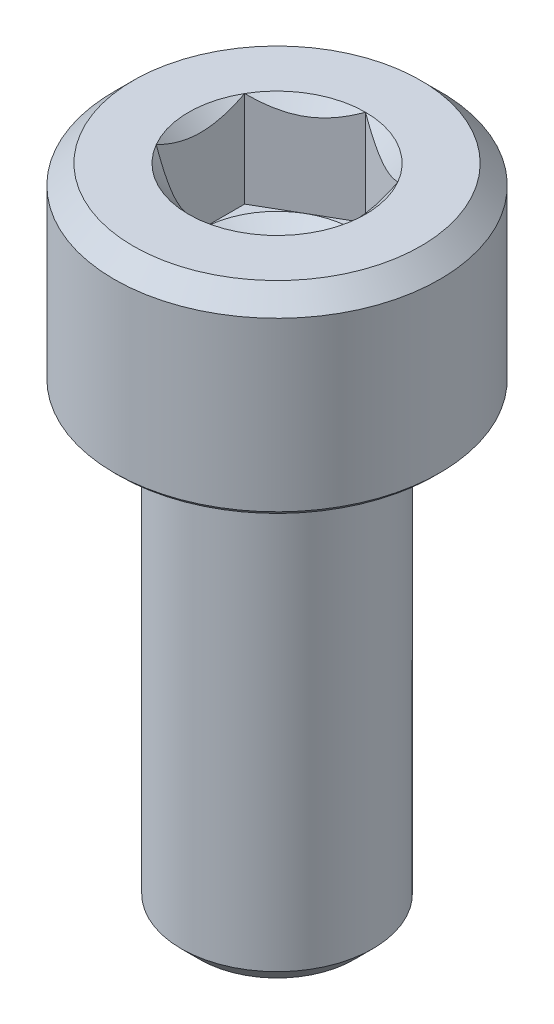
ISO-10303-21;
HEADER;
FILE_DESCRIPTION(('STEP AP214'),'2;1');
FILE_NAME('part.step','',(''),(''),'','','');
FILE_SCHEMA(('AUTOMOTIVE_DESIGN { 1 0 10303 214 1 1 1 1 }'));
ENDSEC;
DATA;
#1=APPLICATION_CONTEXT('core data for automotive mechanical design processes');
#2=APPLICATION_PROTOCOL_DEFINITION('international standard','automotive_design',2000,#1);
#3=PRODUCT_CONTEXT('',#1,'mechanical');
#4=PRODUCT('Part','Part','',(#3));
#5=PRODUCT_RELATED_PRODUCT_CATEGORY('part','',(#4));
#6=PRODUCT_DEFINITION_FORMATION('','',#4);
#7=PRODUCT_DEFINITION_CONTEXT('part definition',#1,'design');
#8=PRODUCT_DEFINITION('design','',#6,#7);
#9=PRODUCT_DEFINITION_SHAPE('','',#8);
#10=(LENGTH_UNIT() NAMED_UNIT(*) SI_UNIT(.MILLI.,.METRE.));
#11=(NAMED_UNIT(*) PLANE_ANGLE_UNIT() SI_UNIT($,.RADIAN.));
#12=(NAMED_UNIT(*) SI_UNIT($,.STERADIAN.) SOLID_ANGLE_UNIT());
#13=UNCERTAINTY_MEASURE_WITH_UNIT(LENGTH_MEASURE(1.E-05),#10,'distance_accuracy_value','');
#14=(GEOMETRIC_REPRESENTATION_CONTEXT(3) GLOBAL_UNCERTAINTY_ASSIGNED_CONTEXT((#13)) GLOBAL_UNIT_ASSIGNED_CONTEXT((#10,
#11,#12)) REPRESENTATION_CONTEXT('',''));
#15=CARTESIAN_POINT('',(0.,0.,0.));
#16=DIRECTION('',(0.,0.,1.));
#17=DIRECTION('',(1.,0.,0.));
#18=AXIS2_PLACEMENT_3D('',#15,#16,#17);
#19=CARTESIAN_POINT('',(0.,5.,0.));
#20=DIRECTION('',(0.,1.,0.));
#21=DIRECTION('',(0.,0.,1.));
#22=AXIS2_PLACEMENT_3D('',#19,#20,#21);
#23=CONICAL_SURFACE('',#22,2.3094010767585,0.785398163397443);
#24=CARTESIAN_POINT('',(0.,5.,0.));
#25=DIRECTION('',(0.,1.,0.));
#26=DIRECTION('',(0.,0.,1.));
#27=AXIS2_PLACEMENT_3D('',#24,#25,#26);
#28=CIRCLE('',#27,2.3094010767585);
#29=CARTESIAN_POINT('',(-2.,5.,-1.1547005383793));
#30=VERTEX_POINT('',#29);
#31=CARTESIAN_POINT('',(-1.99999999999995,5.,1.15470053837933));
#32=VERTEX_POINT('',#31);
#33=EDGE_CURVE('E244',#30,#32,#28,.T.);
#34=ORIENTED_EDGE('',*,*,#33,.T.);
#35=CARTESIAN_POINT('',(-2.,6.70865499521104,3.48493537924179));
#36=CARTESIAN_POINT('',(-2.,6.61927874799566,3.38184597960108));
#37=CARTESIAN_POINT('',(-2.,6.53042050100165,3.27829801866238));
#38=CARTESIAN_POINT('',(-2.,6.35410938767827,3.06992943838188));
#39=CARTESIAN_POINT('',(-2.,6.26665721017001,2.96510823693147));
#40=CARTESIAN_POINT('',(-2.,6.09162252246031,2.75150553836106));
#41=CARTESIAN_POINT('',(-2.,6.00408331853338,2.64268841410052));
#42=CARTESIAN_POINT('',(-2.,5.83166422486036,2.42300125193062));
#43=CARTESIAN_POINT('',(-2.,5.74678367399901,2.31213173546716));
#44=CARTESIAN_POINT('',(-2.,5.58057752677812,2.08751128165374));
#45=CARTESIAN_POINT('',(-2.,5.49925685260335,1.97375667808642));
#46=CARTESIAN_POINT('',(-2.,5.34184669326612,1.74250088545254));
#47=CARTESIAN_POINT('',(-2.,5.26576149836547,1.62499673652244));
#48=CARTESIAN_POINT('',(-2.,5.1220877183608,1.38607583721067));
#49=CARTESIAN_POINT('',(-2.,5.05443808556479,1.26469628611468));
#50=CARTESIAN_POINT('',(-2.,4.93125075275314,1.01594779490905));
#51=CARTESIAN_POINT('',(-2.,4.87569076817092,0.888590409780999));
#52=CARTESIAN_POINT('',(-2.,4.80571297250022,0.691083080219615));
#53=CARTESIAN_POINT('',(-2.,4.78445360220783,0.623368585918478));
#54=CARTESIAN_POINT('',(-2.,4.74782417137952,0.486345144048305));
#55=CARTESIAN_POINT('',(-2.,4.7324531708274,0.417036452850244));
#56=CARTESIAN_POINT('',(-2.,4.70862178314111,0.277659447369613));
#57=CARTESIAN_POINT('',(-2.,4.70011930731512,0.207598466966348));
#58=CARTESIAN_POINT('',(-2.,4.69049074221896,0.0669670350324534));
#59=CARTESIAN_POINT('',(-2.,4.68936387797233,-0.00360336219221853));
#60=CARTESIAN_POINT('',(-2.,4.69457684389318,-0.144553783114206));
#61=CARTESIAN_POINT('',(-2.,4.70092642398597,-0.214933437991822));
#62=CARTESIAN_POINT('',(-2.,4.72062790275544,-0.354698452121242));
#63=CARTESIAN_POINT('',(-2.,4.73398118039419,-0.424083612801693));
#64=CARTESIAN_POINT('',(-2.,4.76693306790516,-0.561849214257608));
#65=CARTESIAN_POINT('',(-2.,4.78657533412024,-0.630219027882827));
#66=CARTESIAN_POINT('',(-2.,4.83104362393443,-0.765224928840582));
#67=CARTESIAN_POINT('',(-2.,4.85586970498648,-0.831860996948566));
#68=CARTESIAN_POINT('',(-2.,4.91579733674519,-0.978223263821283));
#69=CARTESIAN_POINT('',(-2.,4.95195365366887,-1.05751393733744));
#70=CARTESIAN_POINT('',(-2.,5.02908857554939,-1.21373425446361));
#71=CARTESIAN_POINT('',(-2.,5.07006996654331,-1.29066250134966));
#72=CARTESIAN_POINT('',(-2.,5.15578343078954,-1.44259332598881));
#73=CARTESIAN_POINT('',(-2.,5.20052309801051,-1.51759158443124));
#74=CARTESIAN_POINT('',(-2.,5.29281710332292,-1.6658027451741));
#75=CARTESIAN_POINT('',(-2.,5.34037088158692,-1.73901599851123));
#76=CARTESIAN_POINT('',(-2.,5.43793273052148,-1.88434580060754));
#77=CARTESIAN_POINT('',(-2.,5.48795248279123,-1.95645447101685));
#78=CARTESIAN_POINT('',(-2.,5.58974868867912,-2.09942399496133));
#79=CARTESIAN_POINT('',(-2.,5.64152527469528,-2.17028475383773));
#80=CARTESIAN_POINT('',(-2.,5.79881562893284,-2.38113790846102));
#81=CARTESIAN_POINT('',(-2.,5.90641011816337,-2.51957625011744));
#82=CARTESIAN_POINT('',(-2.,6.12880481407568,-2.79793708137349));
#83=CARTESIAN_POINT('',(-2.,6.24372553752213,-2.93776233320845));
#84=CARTESIAN_POINT('',(-2.,6.4175122615703,-3.14503859467228));
#85=CARTESIAN_POINT('',(-2.,6.47535435122021,-3.21335225569823));
#86=CARTESIAN_POINT('',(-2.,6.59160375586807,-3.34949093797161));
#87=CARTESIAN_POINT('',(-2.,6.65001104087957,-3.41731598481301));
#88=CARTESIAN_POINT('',(-2.,6.70865499521104,-3.48493537924179));
#89=B_SPLINE_CURVE_WITH_KNOTS('',3,(#35,#36,#37,#38,#39,#40,#41,#42,#43,#44,#45,#46,#47,#48,#49,
#50,#51,#52,#53,#54,#55,#56,#57,#58,#59,#60,#61,#62,#63,#64,#65,#66,#67,#68,#69,#70,#71,#72,#73,
#74,#75,#76,#77,#78,#79,#80,#81,#82,#83,#84,#85,#86,#87,#88),.UNSPECIFIED.,.F.,.F.,(4,2,2,2,2,2,
2,2,2,2,2,2,2,2,2,2,2,2,2,2,2,2,2,2,2,2,4),(0.,0.409325277655496,0.818845319083793,
1.23778871017889,1.65662708384643,2.07602738016859,2.49576736290813,2.91226761680364,
3.32799351692011,3.54070099927128,3.75337451094884,3.96473470800344,4.17607269648514,
4.38768659336544,4.59934217067773,4.81250006998803,5.02566033188269,5.2868742678538,
5.54823977746819,5.8101467266179,6.07200174711857,6.33524589307928,6.59850992182926,
7.12440155307772,7.66733187119025,7.93586643479269,8.20438682857146),.UNSPECIFIED.);
#90=EDGE_CURVE('E131',#32,#30,#89,.T.);
#91=ORIENTED_EDGE('',*,*,#90,.T.);
#92=EDGE_LOOP('',(#34,#91));
#93=FACE_BOUND('',#92,.T.);
#94=ADVANCED_FACE('F39',(#93),#23,.F.);
#95=CARTESIAN_POINT('',(0.,5.,-2.3094010767585));
#96=VERTEX_POINT('',#95);
#97=EDGE_CURVE('E246',#96,#30,#28,.T.);
#98=ORIENTED_EDGE('',*,*,#97,.T.);
#99=CARTESIAN_POINT('',(-2.0002,5.00011547871369,-1.15458506832546));
#100=CARTESIAN_POINT('',(-1.93144696596929,4.96045309022562,-1.19427965103069));
#101=CARTESIAN_POINT('',(-1.86154425786449,4.92311998228419,-1.23463799837208));
#102=CARTESIAN_POINT('',(-1.71900475544956,4.85476368513617,-1.31693321846149));
#103=CARTESIAN_POINT('',(-1.64635440243464,4.82377853373725,-1.35887791933138));
#104=CARTESIAN_POINT('',(-1.49985839894602,4.77070021654417,-1.44345742638073));
#105=CARTESIAN_POINT('',(-1.4260500647537,4.74847362717663,-1.48607068799511));
#106=CARTESIAN_POINT('',(-1.27680836816473,4.7142288166751,-1.57223542169506));
#107=CARTESIAN_POINT('',(-1.20137956608184,4.70218502914416,-1.61578426088227));
#108=CARTESIAN_POINT('',(-1.07138449932891,4.69131851190559,-1.69083694766539));
#109=CARTESIAN_POINT('',(-1.01698621602988,4.68970975360999,-1.72224381117154));
#110=CARTESIAN_POINT('',(-0.908278544480294,4.69241887759873,-1.78500621460366));
#111=CARTESIAN_POINT('',(-0.853969194078648,4.69673883775799,-1.81636173267757));
#112=CARTESIAN_POINT('',(-0.745863272410649,4.71105956740992,-1.87877671565358));
#113=CARTESIAN_POINT('',(-0.692067343445194,4.72106669276202,-1.90983580972309));
#114=CARTESIAN_POINT('',(-0.585405737694413,4.74621243024967,-1.97141691651549));
#115=CARTESIAN_POINT('',(-0.532539989929274,4.76135064904225,-2.00193897021861));
#116=CARTESIAN_POINT('',(-0.397120266910144,4.8062945034292,-2.08012358375728));
#117=CARTESIAN_POINT('',(-0.315406165150512,4.83948883942583,-2.12730124240479));
#118=CARTESIAN_POINT('',(-0.195252962742192,4.89552582317138,-2.19667172615923));
#119=CARTESIAN_POINT('',(-0.155657147890818,4.91521470294695,-2.21953238052245));
#120=CARTESIAN_POINT('',(-0.0771990411121251,4.95638731836488,-2.26483018959124));
#121=CARTESIAN_POINT('',(-0.0383363164062583,4.97786995165125,-2.28726759416161));
#122=CARTESIAN_POINT('',(0.000200000000000129,5.00011547871366,-2.30951654681234));
#123=B_SPLINE_CURVE_WITH_KNOTS('',3,(#99,#100,#101,#102,#103,#104,#105,#106,#107,#108,#109,#110,
#111,#112,#113,#114,#115,#116,#117,#118,#119,#120,#121,#122),.UNSPECIFIED.,.F.,.F.,(4,2,2,2,2,2,
2,2,2,2,2,4),(0.,0.266420613771064,0.53439375152339,0.798110374376917,1.06116288956937,
1.24939906803722,1.43770123566248,1.62621426093932,1.81471283831913,2.11415604834143,
2.26347170717788,2.41269626969768),.UNSPECIFIED.);
#124=EDGE_CURVE('E206',#30,#96,#123,.T.);
#125=ORIENTED_EDGE('',*,*,#124,.T.);
#126=EDGE_LOOP('',(#98,#125));
#127=FACE_BOUND('',#126,.T.);
#128=ADVANCED_FACE('F290',(#127),#23,.F.);
#129=CARTESIAN_POINT('',(2.,5.,-1.1547005383793));
#130=VERTEX_POINT('',#129);
#131=EDGE_CURVE('E243',#130,#96,#28,.T.);
#132=ORIENTED_EDGE('',*,*,#131,.T.);
#133=CARTESIAN_POINT('',(-0.0002,5.00011547871366,-2.30951654681234));
#134=CARTESIAN_POINT('',(0.0685530340307034,4.96045309022559,-2.26982196410711));
#135=CARTESIAN_POINT('',(0.138455742135508,4.92311998228417,-2.22946361676572));
#136=CARTESIAN_POINT('',(0.280995244550428,4.85476368513615,-2.14716839667631));
#137=CARTESIAN_POINT('',(0.353645597565348,4.82377853373723,-2.10522369580643));
#138=CARTESIAN_POINT('',(0.500141601053956,4.77070021654416,-2.02064418875708));
#139=CARTESIAN_POINT('',(0.573949935246276,4.74847362717663,-1.97803092714271));
#140=CARTESIAN_POINT('',(0.723191631835241,4.7142288166751,-1.89186619344276));
#141=CARTESIAN_POINT('',(0.798620433918126,4.70218502914415,-1.84831735425555));
#142=CARTESIAN_POINT('',(0.928615500671051,4.69131851190559,-1.77326466747243));
#143=CARTESIAN_POINT('',(0.983013783970081,4.68970975360999,-1.74185780396629));
#144=CARTESIAN_POINT('',(1.09172145551967,4.69241887759873,-1.67909540053416));
#145=CARTESIAN_POINT('',(1.14603080592131,4.69673883775799,-1.64773988246026));
#146=CARTESIAN_POINT('',(1.25413672758931,4.71105956740992,-1.58532489948425));
#147=CARTESIAN_POINT('',(1.30793265655476,4.72106669276202,-1.55426580541474));
#148=CARTESIAN_POINT('',(1.41459426230555,4.74621243024968,-1.49268469862233));
#149=CARTESIAN_POINT('',(1.46746001007068,4.76135064904226,-1.46216264491922));
#150=CARTESIAN_POINT('',(1.60287973308982,4.80629450342921,-1.38397803138054));
#151=CARTESIAN_POINT('',(1.68459383484946,4.83948883942584,-1.33680037273302));
#152=CARTESIAN_POINT('',(1.80474703725779,4.89552582317139,-1.26742988897858));
#153=CARTESIAN_POINT('',(1.84434285210917,4.91521470294696,-1.24456923461536));
#154=CARTESIAN_POINT('',(1.92280095888787,4.9563873183649,-1.19927142554657));
#155=CARTESIAN_POINT('',(1.96166368359374,4.97786995165127,-1.17683402097619));
#156=CARTESIAN_POINT('',(2.0002,5.00011547871369,-1.15458506832546));
#157=B_SPLINE_CURVE_WITH_KNOTS('',3,(#133,#134,#135,#136,#137,#138,#139,#140,#141,#142,#143,
#144,#145,#146,#147,#148,#149,#150,#151,#152,#153,#154,#155,#156),.UNSPECIFIED.,.F.,.F.,(4,2,2,
2,2,2,2,2,2,2,2,4),(0.,0.266420613771052,0.534393751523364,0.798110374376878,1.06116288956932,
1.24939906803717,1.43770123566242,1.62621426093926,1.81471283831908,2.11415604834141,
2.26347170717787,2.41269626969768),.UNSPECIFIED.);
#158=EDGE_CURVE('E257',#96,#130,#157,.T.);
#159=ORIENTED_EDGE('',*,*,#158,.T.);
#160=EDGE_LOOP('',(#132,#159));
#161=FACE_BOUND('',#160,.T.);
#162=ADVANCED_FACE('F255',(#161),#23,.F.);
#163=CARTESIAN_POINT('',(2.,5.,1.1547005383793));
#164=VERTEX_POINT('',#163);
#165=EDGE_CURVE('E238',#164,#130,#28,.T.);
#166=ORIENTED_EDGE('',*,*,#165,.T.);
#167=CARTESIAN_POINT('',(2.,6.70865499521104,-3.48493537924179));
#168=CARTESIAN_POINT('',(2.,6.61927874799566,-3.38184597960108));
#169=CARTESIAN_POINT('',(2.,6.53042050100165,-3.27829801866238));
#170=CARTESIAN_POINT('',(2.,6.35410938767827,-3.06992943838188));
#171=CARTESIAN_POINT('',(2.,6.26665721017001,-2.96510823693147));
#172=CARTESIAN_POINT('',(2.,6.09162252246031,-2.75150553836106));
#173=CARTESIAN_POINT('',(2.,6.00408331853338,-2.64268841410052));
#174=CARTESIAN_POINT('',(2.,5.83166422486036,-2.42300125193062));
#175=CARTESIAN_POINT('',(2.,5.74678367399901,-2.31213173546716));
#176=CARTESIAN_POINT('',(2.,5.58057752677812,-2.08751128165374));
#177=CARTESIAN_POINT('',(2.,5.49925685260335,-1.97375667808642));
#178=CARTESIAN_POINT('',(2.,5.34184669326612,-1.74250088545254));
#179=CARTESIAN_POINT('',(2.,5.26576149836547,-1.62499673652244));
#180=CARTESIAN_POINT('',(2.,5.1220877183608,-1.38607583721067));
#181=CARTESIAN_POINT('',(2.,5.05443808556479,-1.26469628611468));
#182=CARTESIAN_POINT('',(2.,4.93125075275314,-1.01594779490905));
#183=CARTESIAN_POINT('',(2.,4.87569076817092,-0.888590409780999));
#184=CARTESIAN_POINT('',(2.,4.80571297250022,-0.691083080219615));
#185=CARTESIAN_POINT('',(2.,4.78445360220783,-0.623368585918478));
#186=CARTESIAN_POINT('',(2.,4.74782417137952,-0.486345144048305));
#187=CARTESIAN_POINT('',(2.,4.7324531708274,-0.417036452850244));
#188=CARTESIAN_POINT('',(2.,4.70862178314111,-0.277659447369613));
#189=CARTESIAN_POINT('',(2.,4.70011930731512,-0.207598466966348));
#190=CARTESIAN_POINT('',(2.,4.69049074221896,-0.0669670350324534));
#191=CARTESIAN_POINT('',(2.,4.68936387797233,0.00360336219221853));
#192=CARTESIAN_POINT('',(2.,4.69457684389318,0.144553783114206));
#193=CARTESIAN_POINT('',(2.,4.70092642398597,0.214933437991822));
#194=CARTESIAN_POINT('',(2.,4.72062790275544,0.354698452121242));
#195=CARTESIAN_POINT('',(2.,4.73398118039419,0.424083612801693));
#196=CARTESIAN_POINT('',(2.,4.76693306790516,0.561849214257608));
#197=CARTESIAN_POINT('',(2.,4.78657533412024,0.630219027882827));
#198=CARTESIAN_POINT('',(2.,4.83104362393443,0.765224928840582));
#199=CARTESIAN_POINT('',(2.,4.85586970498648,0.831860996948566));
#200=CARTESIAN_POINT('',(2.,4.91579733674519,0.978223263821283));
#201=CARTESIAN_POINT('',(2.,4.95195365366887,1.05751393733744));
#202=CARTESIAN_POINT('',(2.,5.02908857554939,1.21373425446361));
#203=CARTESIAN_POINT('',(2.,5.07006996654331,1.29066250134966));
#204=CARTESIAN_POINT('',(2.,5.15578343078954,1.44259332598881));
#205=CARTESIAN_POINT('',(2.,5.20052309801051,1.51759158443124));
#206=CARTESIAN_POINT('',(2.,5.29281710332292,1.6658027451741));
#207=CARTESIAN_POINT('',(2.,5.34037088158692,1.73901599851123));
#208=CARTESIAN_POINT('',(2.,5.43793273052148,1.88434580060754));
#209=CARTESIAN_POINT('',(2.,5.48795248279123,1.95645447101685));
#210=CARTESIAN_POINT('',(2.,5.58974868867912,2.09942399496133));
#211=CARTESIAN_POINT('',(2.,5.64152527469528,2.17028475383773));
#212=CARTESIAN_POINT('',(2.,5.79881562893284,2.38113790846102));
#213=CARTESIAN_POINT('',(2.,5.90641011816337,2.51957625011744));
#214=CARTESIAN_POINT('',(2.,6.12880481407568,2.79793708137349));
#215=CARTESIAN_POINT('',(2.,6.24372553752213,2.93776233320845));
#216=CARTESIAN_POINT('',(2.,6.4175122615703,3.14503859467228));
#217=CARTESIAN_POINT('',(2.,6.47535435122021,3.21335225569823));
#218=CARTESIAN_POINT('',(2.,6.59160375586807,3.34949093797161));
#219=CARTESIAN_POINT('',(2.,6.65001104087957,3.41731598481301));
#220=CARTESIAN_POINT('',(2.,6.70865499521104,3.48493537924179));
#221=B_SPLINE_CURVE_WITH_KNOTS('',3,(#167,#168,#169,#170,#171,#172,#173,#174,#175,#176,#177,
#178,#179,#180,#181,#182,#183,#184,#185,#186,#187,#188,#189,#190,#191,#192,#193,#194,#195,#196,
#197,#198,#199,#200,#201,#202,#203,#204,#205,#206,#207,#208,#209,#210,#211,#212,#213,#214,#215,
#216,#217,#218,#219,#220),.UNSPECIFIED.,.F.,.F.,(4,2,2,2,2,2,2,2,2,2,2,2,2,2,2,2,2,2,2,2,2,2,2,
2,2,2,4),(0.,0.409325277655496,0.818845319083793,1.23778871017889,1.65662708384643,
2.07602738016859,2.49576736290813,2.91226761680364,3.32799351692011,3.54070099927128,
3.75337451094884,3.96473470800344,4.17607269648514,4.38768659336544,4.59934217067773,
4.81250006998803,5.02566033188269,5.2868742678538,5.54823977746819,5.8101467266179,
6.07200174711857,6.33524589307928,6.59850992182926,7.12440155307772,7.66733187119025,
7.93586643479269,8.20438682857146),.UNSPECIFIED.);
#222=EDGE_CURVE('E265',#130,#164,#221,.T.);
#223=ORIENTED_EDGE('',*,*,#222,.T.);
#224=EDGE_LOOP('',(#166,#223));
#225=FACE_BOUND('',#224,.T.);
#226=ADVANCED_FACE('F264',(#225),#23,.F.);
#227=CARTESIAN_POINT('',(0.,5.,2.3094010767585));
#228=VERTEX_POINT('',#227);
#229=EDGE_CURVE('E236',#228,#164,#28,.T.);
#230=ORIENTED_EDGE('',*,*,#229,.T.);
#231=CARTESIAN_POINT('',(2.0002,5.00011547871369,1.15458506832546));
#232=CARTESIAN_POINT('',(1.93144696596929,4.96045309022562,1.19427965103069));
#233=CARTESIAN_POINT('',(1.86154425786449,4.92311998228419,1.23463799837208));
#234=CARTESIAN_POINT('',(1.71900475544956,4.85476368513617,1.31693321846149));
#235=CARTESIAN_POINT('',(1.64635440243464,4.82377853373725,1.35887791933138));
#236=CARTESIAN_POINT('',(1.49985839894602,4.77070021654417,1.44345742638073));
#237=CARTESIAN_POINT('',(1.4260500647537,4.74847362717663,1.48607068799511));
#238=CARTESIAN_POINT('',(1.27680836816473,4.7142288166751,1.57223542169506));
#239=CARTESIAN_POINT('',(1.20137956608184,4.70218502914416,1.61578426088227));
#240=CARTESIAN_POINT('',(1.07138449932891,4.69131851190559,1.69083694766539));
#241=CARTESIAN_POINT('',(1.01698621602988,4.68970975360999,1.72224381117154));
#242=CARTESIAN_POINT('',(0.908278544480294,4.69241887759873,1.78500621460366));
#243=CARTESIAN_POINT('',(0.853969194078648,4.69673883775799,1.81636173267757));
#244=CARTESIAN_POINT('',(0.745863272410649,4.71105956740992,1.87877671565358));
#245=CARTESIAN_POINT('',(0.692067343445194,4.72106669276202,1.90983580972309));
#246=CARTESIAN_POINT('',(0.585405737694413,4.74621243024967,1.97141691651549));
#247=CARTESIAN_POINT('',(0.532539989929274,4.76135064904225,2.00193897021861));
#248=CARTESIAN_POINT('',(0.397120266910144,4.8062945034292,2.08012358375728));
#249=CARTESIAN_POINT('',(0.315406165150512,4.83948883942583,2.12730124240479));
#250=CARTESIAN_POINT('',(0.195252962742192,4.89552582317138,2.19667172615923));
#251=CARTESIAN_POINT('',(0.155657147890818,4.91521470294695,2.21953238052245));
#252=CARTESIAN_POINT('',(0.0771990411121251,4.95638731836488,2.26483018959124));
#253=CARTESIAN_POINT('',(0.0383363164062583,4.97786995165125,2.28726759416161));
#254=CARTESIAN_POINT('',(-0.000200000000000129,5.00011547871366,2.30951654681234));
#255=B_SPLINE_CURVE_WITH_KNOTS('',3,(#231,#232,#233,#234,#235,#236,#237,#238,#239,#240,#241,
#242,#243,#244,#245,#246,#247,#248,#249,#250,#251,#252,#253,#254),.UNSPECIFIED.,.F.,.F.,(4,2,2,
2,2,2,2,2,2,2,2,4),(0.,0.266420613771064,0.53439375152339,0.798110374376917,1.06116288956937,
1.24939906803722,1.43770123566248,1.62621426093932,1.81471283831913,2.11415604834143,
2.26347170717788,2.41269626969768),.UNSPECIFIED.);
#256=EDGE_CURVE('E175',#164,#228,#255,.T.);
#257=ORIENTED_EDGE('',*,*,#256,.T.);
#258=EDGE_LOOP('',(#230,#257));
#259=FACE_BOUND('',#258,.T.);
#260=ADVANCED_FACE('F295',(#259),#23,.F.);
#261=EDGE_CURVE('E235',#32,#228,#28,.T.);
#262=ORIENTED_EDGE('',*,*,#261,.T.);
#263=CARTESIAN_POINT('',(0.0002,5.00011547871366,2.30951654681234));
#264=CARTESIAN_POINT('',(-0.0685530340307034,4.96045309022559,2.26982196410711));
#265=CARTESIAN_POINT('',(-0.138455742135508,4.92311998228417,2.22946361676572));
#266=CARTESIAN_POINT('',(-0.280995244550428,4.85476368513615,2.14716839667631));
#267=CARTESIAN_POINT('',(-0.353645597565348,4.82377853373723,2.10522369580643));
#268=CARTESIAN_POINT('',(-0.500141601053956,4.77070021654416,2.02064418875708));
#269=CARTESIAN_POINT('',(-0.573949935246276,4.74847362717663,1.97803092714271));
#270=CARTESIAN_POINT('',(-0.723191631835241,4.7142288166751,1.89186619344276));
#271=CARTESIAN_POINT('',(-0.798620433918126,4.70218502914415,1.84831735425555));
#272=CARTESIAN_POINT('',(-0.928615500671051,4.69131851190559,1.77326466747243));
#273=CARTESIAN_POINT('',(-0.983013783970081,4.68970975360999,1.74185780396629));
#274=CARTESIAN_POINT('',(-1.09172145551967,4.69241887759873,1.67909540053416));
#275=CARTESIAN_POINT('',(-1.14603080592131,4.69673883775799,1.64773988246026));
#276=CARTESIAN_POINT('',(-1.25413672758931,4.71105956740992,1.58532489948425));
#277=CARTESIAN_POINT('',(-1.30793265655476,4.72106669276202,1.55426580541474));
#278=CARTESIAN_POINT('',(-1.41459426230555,4.74621243024968,1.49268469862233));
#279=CARTESIAN_POINT('',(-1.46746001007068,4.76135064904226,1.46216264491922));
#280=CARTESIAN_POINT('',(-1.60287973308982,4.80629450342921,1.38397803138054));
#281=CARTESIAN_POINT('',(-1.68459383484946,4.83948883942584,1.33680037273302));
#282=CARTESIAN_POINT('',(-1.80474703725779,4.89552582317139,1.26742988897858));
#283=CARTESIAN_POINT('',(-1.84434285210917,4.91521470294696,1.24456923461536));
#284=CARTESIAN_POINT('',(-1.92280095888787,4.9563873183649,1.19927142554657));
#285=CARTESIAN_POINT('',(-1.96166368359374,4.97786995165127,1.17683402097619));
#286=CARTESIAN_POINT('',(-2.0002,5.00011547871369,1.15458506832546));
#287=B_SPLINE_CURVE_WITH_KNOTS('',3,(#263,#264,#265,#266,#267,#268,#269,#270,#271,#272,#273,
#274,#275,#276,#277,#278,#279,#280,#281,#282,#283,#284,#285,#286),.UNSPECIFIED.,.F.,.F.,(4,2,2,
2,2,2,2,2,2,2,2,4),(0.,0.266420613771052,0.534393751523364,0.798110374376878,1.06116288956932,
1.24939906803717,1.43770123566242,1.62621426093926,1.81471283831908,2.11415604834141,
2.26347170717787,2.41269626969768),.UNSPECIFIED.);
#288=EDGE_CURVE('E62',#228,#32,#287,.T.);
#289=ORIENTED_EDGE('',*,*,#288,.T.);
#290=EDGE_LOOP('',(#262,#289));
#291=FACE_BOUND('',#290,.T.);
#292=ADVANCED_FACE('F182',(#291),#23,.F.);
#293=CARTESIAN_POINT('',(2.3094010767585,5.,0.));
#294=DIRECTION('',(0.,-1.,0.));
#295=DIRECTION('',(0.,0.,-1.));
#296=AXIS2_PLACEMENT_3D('',#293,#294,#295);
#297=PLANE('',#296);
#298=ORIENTED_EDGE('',*,*,#229,.F.);
#299=ORIENTED_EDGE('',*,*,#261,.F.);
#300=ORIENTED_EDGE('',*,*,#33,.F.);
#301=ORIENTED_EDGE('',*,*,#97,.F.);
#302=ORIENTED_EDGE('',*,*,#131,.F.);
#303=ORIENTED_EDGE('',*,*,#165,.F.);
#304=EDGE_LOOP('',(#298,#299,#300,#301,#302,#303));
#305=FACE_BOUND('',#304,.T.);
#306=CARTESIAN_POINT('',(0.,5.,0.));
#307=DIRECTION('',(0.,1.,0.));
#308=DIRECTION('',(0.,0.,1.));
#309=AXIS2_PLACEMENT_3D('',#306,#307,#308);
#310=CIRCLE('',#309,3.75);
#311=CARTESIAN_POINT('',(0.,5.,3.75));
#312=VERTEX_POINT('',#311);
#313=EDGE_CURVE('E233',#312,#312,#310,.T.);
#314=ORIENTED_EDGE('',*,*,#313,.T.);
#315=EDGE_LOOP('',(#314));
#316=FACE_BOUND('',#315,.T.);
#317=ADVANCED_FACE('F261',(#305,#316),#297,.F.);
#318=CARTESIAN_POINT('',(0.,4.5,0.));
#319=DIRECTION('',(0.,-1.,0.));
#320=DIRECTION('',(0.,0.,-1.));
#321=AXIS2_PLACEMENT_3D('',#318,#319,#320);
#322=CONICAL_SURFACE('',#321,4.25,0.785398163397448);
#323=ORIENTED_EDGE('',*,*,#313,.F.);
#324=EDGE_LOOP('',(#323));
#325=FACE_BOUND('',#324,.T.);
#326=CARTESIAN_POINT('',(0.,4.5,0.));
#327=DIRECTION('',(0.,1.,0.));
#328=DIRECTION('',(0.,0.,1.));
#329=AXIS2_PLACEMENT_3D('',#326,#327,#328);
#330=CIRCLE('',#329,4.25);
#331=CARTESIAN_POINT('',(0.,4.5,4.25));
#332=VERTEX_POINT('',#331);
#333=EDGE_CURVE('E230',#332,#332,#330,.T.);
#334=ORIENTED_EDGE('',*,*,#333,.T.);
#335=EDGE_LOOP('',(#334));
#336=FACE_BOUND('',#335,.T.);
#337=ADVANCED_FACE('F300',(#325,#336),#322,.T.);
#338=CARTESIAN_POINT('',(0.,-12.,0.));
#339=DIRECTION('',(0.,1.,0.));
#340=DIRECTION('',(0.,0.,1.));
#341=AXIS2_PLACEMENT_3D('',#338,#339,#340);
#342=CYLINDRICAL_SURFACE('',#341,4.25);
#343=ORIENTED_EDGE('',*,*,#333,.F.);
#344=EDGE_LOOP('',(#343));
#345=FACE_BOUND('',#344,.T.);
#346=CARTESIAN_POINT('',(0.,0.125,0.));
#347=DIRECTION('',(0.,1.,0.));
#348=DIRECTION('',(0.,0.,1.));
#349=AXIS2_PLACEMENT_3D('',#346,#347,#348);
#350=CIRCLE('',#349,4.25);
#351=CARTESIAN_POINT('',(0.,0.125,4.25));
#352=VERTEX_POINT('',#351);
#353=EDGE_CURVE('E227',#352,#352,#350,.T.);
#354=ORIENTED_EDGE('',*,*,#353,.T.);
#355=EDGE_LOOP('',(#354));
#356=FACE_BOUND('',#355,.T.);
#357=ADVANCED_FACE('F378',(#345,#356),#342,.T.);
#358=CARTESIAN_POINT('',(0.,0.,0.));
#359=DIRECTION('',(0.,1.,0.));
#360=DIRECTION('',(0.,0.,1.));
#361=AXIS2_PLACEMENT_3D('',#358,#359,#360);
#362=CONICAL_SURFACE('',#361,4.125,0.785398163397448);
#363=ORIENTED_EDGE('',*,*,#353,.F.);
#364=EDGE_LOOP('',(#363));
#365=FACE_BOUND('',#364,.T.);
#366=CARTESIAN_POINT('',(0.,0.,0.));
#367=DIRECTION('',(0.,1.,0.));
#368=DIRECTION('',(0.,0.,1.));
#369=AXIS2_PLACEMENT_3D('',#366,#367,#368);
#370=CIRCLE('',#369,4.125);
#371=CARTESIAN_POINT('',(0.,0.,4.125));
#372=VERTEX_POINT('',#371);
#373=EDGE_CURVE('E224',#372,#372,#370,.T.);
#374=ORIENTED_EDGE('',*,*,#373,.T.);
#375=EDGE_LOOP('',(#374));
#376=FACE_BOUND('',#375,.T.);
#377=ADVANCED_FACE('F382',(#365,#376),#362,.T.);
#378=CARTESIAN_POINT('',(4.125,0.,0.));
#379=DIRECTION('',(0.,1.,0.));
#380=DIRECTION('',(0.,0.,1.));
#381=AXIS2_PLACEMENT_3D('',#378,#379,#380);
#382=PLANE('',#381);
#383=ORIENTED_EDGE('',*,*,#373,.F.);
#384=EDGE_LOOP('',(#383));
#385=FACE_BOUND('',#384,.T.);
#386=CARTESIAN_POINT('',(0.,0.,0.));
#387=DIRECTION('',(0.,1.,0.));
#388=DIRECTION('',(0.,0.,1.));
#389=AXIS2_PLACEMENT_3D('',#386,#387,#388);
#390=CIRCLE('',#389,2.55);
#391=CARTESIAN_POINT('',(0.,0.,2.55));
#392=VERTEX_POINT('',#391);
#393=EDGE_CURVE('E221',#392,#392,#390,.T.);
#394=ORIENTED_EDGE('',*,*,#393,.T.);
#395=EDGE_LOOP('',(#394));
#396=FACE_BOUND('',#395,.T.);
#397=ADVANCED_FACE('F438',(#385,#396),#382,.F.);
#398=CARTESIAN_POINT('',(0.,-0.6,0.));
#399=DIRECTION('',(0.,1.,0.));
#400=DIRECTION('',(0.,0.,1.));
#401=AXIS2_PLACEMENT_3D('',#398,#399,#400);
#402=CONICAL_SURFACE('',#401,2.5,0.0831412318884407);
#403=ORIENTED_EDGE('',*,*,#393,.F.);
#404=EDGE_LOOP('',(#403));
#405=FACE_BOUND('',#404,.T.);
#406=CARTESIAN_POINT('',(0.,-0.6,0.));
#407=DIRECTION('',(0.,1.,0.));
#408=DIRECTION('',(0.,0.,1.));
#409=AXIS2_PLACEMENT_3D('',#406,#407,#408);
#410=CIRCLE('',#409,2.5);
#411=CARTESIAN_POINT('',(0.,-0.6,2.5));
#412=VERTEX_POINT('',#411);
#413=EDGE_CURVE('E218',#412,#412,#410,.T.);
#414=ORIENTED_EDGE('',*,*,#413,.T.);
#415=EDGE_LOOP('',(#414));
#416=FACE_BOUND('',#415,.T.);
#417=ADVANCED_FACE('F427',(#405,#416),#402,.T.);
#418=CARTESIAN_POINT('',(0.,-12.,0.));
#419=DIRECTION('',(0.,1.,0.));
#420=DIRECTION('',(0.,0.,1.));
#421=AXIS2_PLACEMENT_3D('',#418,#419,#420);
#422=CYLINDRICAL_SURFACE('',#421,2.5);
#423=ORIENTED_EDGE('',*,*,#413,.F.);
#424=EDGE_LOOP('',(#423));
#425=FACE_BOUND('',#424,.T.);
#426=CARTESIAN_POINT('',(0.,-11.5095,0.));
#427=DIRECTION('',(0.,1.,0.));
#428=DIRECTION('',(0.,0.,1.));
#429=AXIS2_PLACEMENT_3D('',#426,#427,#428);
#430=CIRCLE('',#429,2.5);
#431=CARTESIAN_POINT('',(0.,-11.5095,2.5));
#432=VERTEX_POINT('',#431);
#433=EDGE_CURVE('E215',#432,#432,#430,.T.);
#434=ORIENTED_EDGE('',*,*,#433,.T.);
#435=EDGE_LOOP('',(#434));
#436=FACE_BOUND('',#435,.T.);
#437=ADVANCED_FACE('F321',(#425,#436),#422,.T.);
#438=CARTESIAN_POINT('',(0.,-12.,0.));
#439=DIRECTION('',(0.,1.,0.));
#440=DIRECTION('',(0.,0.,1.));
#441=AXIS2_PLACEMENT_3D('',#438,#439,#440);
#442=CONICAL_SURFACE('',#441,2.0095,0.785398163397447);
#443=ORIENTED_EDGE('',*,*,#433,.F.);
#444=EDGE_LOOP('',(#443));
#445=FACE_BOUND('',#444,.T.);
#446=CARTESIAN_POINT('',(0.,-12.,0.));
#447=DIRECTION('',(0.,1.,0.));
#448=DIRECTION('',(0.,0.,1.));
#449=AXIS2_PLACEMENT_3D('',#446,#447,#448);
#450=CIRCLE('',#449,2.0095);
#451=CARTESIAN_POINT('',(0.,-12.,2.0095));
#452=VERTEX_POINT('',#451);
#453=EDGE_CURVE('E205',#452,#452,#450,.T.);
#454=ORIENTED_EDGE('',*,*,#453,.T.);
#455=EDGE_LOOP('',(#454));
#456=FACE_BOUND('',#455,.T.);
#457=ADVANCED_FACE('F404',(#445,#456),#442,.T.);
#458=CARTESIAN_POINT('',(2.0095,-12.,0.));
#459=DIRECTION('',(0.,1.,0.));
#460=DIRECTION('',(0.,0.,1.));
#461=AXIS2_PLACEMENT_3D('',#458,#459,#460);
#462=PLANE('',#461);
#463=ORIENTED_EDGE('',*,*,#453,.F.);
#464=EDGE_LOOP('',(#463));
#465=FACE_BOUND('',#464,.T.);
#466=ADVANCED_FACE('F196',(#465),#462,.F.);
#467=CARTESIAN_POINT('',(0.,2.5,0.));
#468=DIRECTION('',(0.,1.,0.));
#469=DIRECTION('',(0.,0.,1.));
#470=AXIS2_PLACEMENT_3D('',#467,#468,#469);
#471=PLANE('',#470);
#472=CARTESIAN_POINT('',(0.,2.5,0.));
#473=DIRECTION('',(0.,1.,0.));
#474=DIRECTION('',(0.,0.,1.));
#475=AXIS2_PLACEMENT_3D('',#472,#473,#474);
#476=CIRCLE('',#475,2.);
#477=CARTESIAN_POINT('',(-2.,2.5,0.));
#478=VERTEX_POINT('',#477);
#479=CARTESIAN_POINT('',(-0.999999999999976,2.5,1.73205080756891));
#480=VERTEX_POINT('',#479);
#481=EDGE_CURVE('E121',#478,#480,#476,.T.);
#482=ORIENTED_EDGE('',*,*,#481,.F.);
#483=DIRECTION('',(0.,0.,1.));
#484=VECTOR('',#483,1.);
#485=CARTESIAN_POINT('',(-2.,2.5,-1.1547005383793));
#486=LINE('',#485,#484);
#487=CARTESIAN_POINT('',(-2.,2.5,1.1547005383793));
#488=VERTEX_POINT('',#487);
#489=EDGE_CURVE('E115',#478,#488,#486,.T.);
#490=ORIENTED_EDGE('',*,*,#489,.T.);
#491=DIRECTION('',(0.866025403784448,0.,0.499999999999983));
#492=VECTOR('',#491,1.);
#493=CARTESIAN_POINT('',(-2.,2.5,1.1547005383793));
#494=LINE('',#493,#492);
#495=EDGE_CURVE('E119',#488,#480,#494,.T.);
#496=ORIENTED_EDGE('',*,*,#495,.T.);
#497=EDGE_LOOP('',(#482,#490,#496));
#498=FACE_BOUND('',#497,.T.);
#499=ADVANCED_FACE('F117',(#498),#471,.T.);
#500=CARTESIAN_POINT('',(-0.999999999999976,2.5,-1.73205080756891));
#501=VERTEX_POINT('',#500);
#502=EDGE_CURVE('E528',#501,#478,#476,.T.);
#503=ORIENTED_EDGE('',*,*,#502,.F.);
#504=DIRECTION('',(-0.866025403784448,0.,0.499999999999983));
#505=VECTOR('',#504,1.);
#506=CARTESIAN_POINT('',(0.,2.5,-2.3094010767585));
#507=LINE('',#506,#505);
#508=CARTESIAN_POINT('',(-2.,2.5,-1.1547005383793));
#509=VERTEX_POINT('',#508);
#510=EDGE_CURVE('E153',#501,#509,#507,.T.);
#511=ORIENTED_EDGE('',*,*,#510,.T.);
#512=EDGE_CURVE('E125',#509,#478,#486,.T.);
#513=ORIENTED_EDGE('',*,*,#512,.T.);
#514=EDGE_LOOP('',(#503,#511,#513));
#515=FACE_BOUND('',#514,.T.);
#516=ADVANCED_FACE('F288',(#515),#471,.T.);
#517=CARTESIAN_POINT('',(0.999999999999976,2.5,-1.73205080756891));
#518=VERTEX_POINT('',#517);
#519=EDGE_CURVE('E527',#518,#501,#476,.T.);
#520=ORIENTED_EDGE('',*,*,#519,.F.);
#521=DIRECTION('',(-0.866025403784448,0.,-0.499999999999983));
#522=VECTOR('',#521,1.);
#523=CARTESIAN_POINT('',(2.,2.5,-1.1547005383793));
#524=LINE('',#523,#522);
#525=CARTESIAN_POINT('',(0.,2.5,-2.3094010767585));
#526=VERTEX_POINT('',#525);
#527=EDGE_CURVE('E149',#518,#526,#524,.T.);
#528=ORIENTED_EDGE('',*,*,#527,.T.);
#529=EDGE_CURVE('E135',#526,#501,#507,.T.);
#530=ORIENTED_EDGE('',*,*,#529,.T.);
#531=EDGE_LOOP('',(#520,#528,#530));
#532=FACE_BOUND('',#531,.T.);
#533=ADVANCED_FACE('F472',(#532),#471,.T.);
#534=CARTESIAN_POINT('',(2.,2.5,0.));
#535=VERTEX_POINT('',#534);
#536=EDGE_CURVE('E47',#535,#518,#476,.T.);
#537=ORIENTED_EDGE('',*,*,#536,.F.);
#538=DIRECTION('',(0.,0.,-1.));
#539=VECTOR('',#538,1.);
#540=CARTESIAN_POINT('',(2.,2.5,1.1547005383793));
#541=LINE('',#540,#539);
#542=CARTESIAN_POINT('',(2.,2.5,-1.1547005383793));
#543=VERTEX_POINT('',#542);
#544=EDGE_CURVE('E145',#535,#543,#541,.T.);
#545=ORIENTED_EDGE('',*,*,#544,.T.);
#546=EDGE_CURVE('E150',#543,#518,#524,.T.);
#547=ORIENTED_EDGE('',*,*,#546,.T.);
#548=EDGE_LOOP('',(#537,#545,#547));
#549=FACE_BOUND('',#548,.T.);
#550=ADVANCED_FACE('F286',(#549),#471,.T.);
#551=CARTESIAN_POINT('',(0.999999999999966,2.5,1.7320508075689));
#552=VERTEX_POINT('',#551);
#553=EDGE_CURVE('E11',#552,#535,#476,.T.);
#554=ORIENTED_EDGE('',*,*,#553,.F.);
#555=DIRECTION('',(0.866025403784448,0.,-0.499999999999983));
#556=VECTOR('',#555,1.);
#557=CARTESIAN_POINT('',(0.,2.5,2.3094010767585));
#558=LINE('',#557,#556);
#559=CARTESIAN_POINT('',(2.,2.5,1.1547005383793));
#560=VERTEX_POINT('',#559);
#561=EDGE_CURVE('E141',#552,#560,#558,.T.);
#562=ORIENTED_EDGE('',*,*,#561,.T.);
#563=EDGE_CURVE('E146',#560,#535,#541,.T.);
#564=ORIENTED_EDGE('',*,*,#563,.T.);
#565=EDGE_LOOP('',(#554,#562,#564));
#566=FACE_BOUND('',#565,.T.);
#567=ADVANCED_FACE('F276',(#566),#471,.T.);
#568=EDGE_CURVE('E48',#480,#552,#476,.T.);
#569=ORIENTED_EDGE('',*,*,#568,.F.);
#570=CARTESIAN_POINT('',(0.,2.5,2.3094010767585));
#571=VERTEX_POINT('',#570);
#572=EDGE_CURVE('E140',#480,#571,#494,.T.);
#573=ORIENTED_EDGE('',*,*,#572,.T.);
#574=EDGE_CURVE('E55',#571,#552,#558,.T.);
#575=ORIENTED_EDGE('',*,*,#574,.T.);
#576=EDGE_LOOP('',(#569,#573,#575));
#577=FACE_BOUND('',#576,.T.);
#578=ADVANCED_FACE('F195',(#577),#471,.T.);
#579=CARTESIAN_POINT('',(-2.,2.5,-1.1547005383793));
#580=DIRECTION('',(-1.,0.,0.));
#581=DIRECTION('',(0.,0.,1.));
#582=AXIS2_PLACEMENT_3D('',#579,#580,#581);
#583=PLANE('',#582);
#584=ORIENTED_EDGE('',*,*,#90,.F.);
#585=DIRECTION('',(0.,1.,0.));
#586=VECTOR('',#585,1.);
#587=CARTESIAN_POINT('',(-2.,2.5,1.1547005383793));
#588=LINE('',#587,#586);
#589=EDGE_CURVE('E128',#488,#32,#588,.T.);
#590=ORIENTED_EDGE('',*,*,#589,.F.);
#591=ORIENTED_EDGE('',*,*,#489,.F.);
#592=ORIENTED_EDGE('',*,*,#512,.F.);
#593=DIRECTION('',(0.,1.,0.));
#594=VECTOR('',#593,1.);
#595=CARTESIAN_POINT('',(-2.,2.5,-1.1547005383793));
#596=LINE('',#595,#594);
#597=EDGE_CURVE('E156',#509,#30,#596,.T.);
#598=ORIENTED_EDGE('',*,*,#597,.T.);
#599=EDGE_LOOP('',(#584,#590,#591,#592,#598));
#600=FACE_BOUND('',#599,.T.);
#601=ADVANCED_FACE('F129',(#600),#583,.F.);
#602=CARTESIAN_POINT('',(0.,2.5,-2.3094010767585));
#603=DIRECTION('',(-0.499999999999983,0.,-0.866025403784448));
#604=DIRECTION('',(-0.866025403784448,0.,0.499999999999983));
#605=AXIS2_PLACEMENT_3D('',#602,#603,#604);
#606=PLANE('',#605);
#607=ORIENTED_EDGE('',*,*,#124,.F.);
#608=ORIENTED_EDGE('',*,*,#597,.F.);
#609=ORIENTED_EDGE('',*,*,#510,.F.);
#610=ORIENTED_EDGE('',*,*,#529,.F.);
#611=DIRECTION('',(0.,1.,0.));
#612=VECTOR('',#611,1.);
#613=CARTESIAN_POINT('',(0.,2.5,-2.3094010767585));
#614=LINE('',#613,#612);
#615=EDGE_CURVE('E158',#526,#96,#614,.T.);
#616=ORIENTED_EDGE('',*,*,#615,.T.);
#617=EDGE_LOOP('',(#607,#608,#609,#610,#616));
#618=FACE_BOUND('',#617,.T.);
#619=ADVANCED_FACE('F194',(#618),#606,.F.);
#620=CARTESIAN_POINT('',(2.,2.5,-1.1547005383793));
#621=DIRECTION('',(0.499999999999983,0.,-0.866025403784448));
#622=DIRECTION('',(-0.866025403784448,0.,-0.499999999999983));
#623=AXIS2_PLACEMENT_3D('',#620,#621,#622);
#624=PLANE('',#623);
#625=ORIENTED_EDGE('',*,*,#158,.F.);
#626=ORIENTED_EDGE('',*,*,#615,.F.);
#627=ORIENTED_EDGE('',*,*,#527,.F.);
#628=ORIENTED_EDGE('',*,*,#546,.F.);
#629=DIRECTION('',(0.,1.,0.));
#630=VECTOR('',#629,1.);
#631=CARTESIAN_POINT('',(2.,2.5,-1.1547005383793));
#632=LINE('',#631,#630);
#633=EDGE_CURVE('E161',#543,#130,#632,.T.);
#634=ORIENTED_EDGE('',*,*,#633,.T.);
#635=EDGE_LOOP('',(#625,#626,#627,#628,#634));
#636=FACE_BOUND('',#635,.T.);
#637=ADVANCED_FACE('F328',(#636),#624,.F.);
#638=CARTESIAN_POINT('',(2.,2.5,1.1547005383793));
#639=DIRECTION('',(1.,0.,0.));
#640=DIRECTION('',(0.,0.,-1.));
#641=AXIS2_PLACEMENT_3D('',#638,#639,#640);
#642=PLANE('',#641);
#643=ORIENTED_EDGE('',*,*,#222,.F.);
#644=ORIENTED_EDGE('',*,*,#633,.F.);
#645=ORIENTED_EDGE('',*,*,#544,.F.);
#646=ORIENTED_EDGE('',*,*,#563,.F.);
#647=DIRECTION('',(0.,1.,0.));
#648=VECTOR('',#647,1.);
#649=CARTESIAN_POINT('',(2.,2.5,1.1547005383793));
#650=LINE('',#649,#648);
#651=EDGE_CURVE('E164',#560,#164,#650,.T.);
#652=ORIENTED_EDGE('',*,*,#651,.T.);
#653=EDGE_LOOP('',(#643,#644,#645,#646,#652));
#654=FACE_BOUND('',#653,.T.);
#655=ADVANCED_FACE('F272',(#654),#642,.F.);
#656=CARTESIAN_POINT('',(0.,2.5,2.3094010767585));
#657=DIRECTION('',(0.499999999999983,0.,0.866025403784448));
#658=DIRECTION('',(0.866025403784448,0.,-0.499999999999983));
#659=AXIS2_PLACEMENT_3D('',#656,#657,#658);
#660=PLANE('',#659);
#661=ORIENTED_EDGE('',*,*,#256,.F.);
#662=ORIENTED_EDGE('',*,*,#651,.F.);
#663=ORIENTED_EDGE('',*,*,#561,.F.);
#664=ORIENTED_EDGE('',*,*,#574,.F.);
#665=DIRECTION('',(0.,1.,0.));
#666=VECTOR('',#665,1.);
#667=CARTESIAN_POINT('',(0.,2.5,2.3094010767585));
#668=LINE('',#667,#666);
#669=EDGE_CURVE('E134',#571,#228,#668,.T.);
#670=ORIENTED_EDGE('',*,*,#669,.T.);
#671=EDGE_LOOP('',(#661,#662,#663,#664,#670));
#672=FACE_BOUND('',#671,.T.);
#673=ADVANCED_FACE('F188',(#672),#660,.F.);
#674=CARTESIAN_POINT('',(-2.,2.5,1.1547005383793));
#675=DIRECTION('',(-0.499999999999983,0.,0.866025403784448));
#676=DIRECTION('',(0.866025403784448,0.,0.499999999999983));
#677=AXIS2_PLACEMENT_3D('',#674,#675,#676);
#678=PLANE('',#677);
#679=ORIENTED_EDGE('',*,*,#288,.F.);
#680=ORIENTED_EDGE('',*,*,#669,.F.);
#681=ORIENTED_EDGE('',*,*,#572,.F.);
#682=ORIENTED_EDGE('',*,*,#495,.F.);
#683=ORIENTED_EDGE('',*,*,#589,.T.);
#684=EDGE_LOOP('',(#679,#680,#681,#682,#683));
#685=FACE_BOUND('',#684,.T.);
#686=ADVANCED_FACE('F138',(#685),#678,.F.);
#687=CARTESIAN_POINT('',(0.,2.5,0.));
#688=DIRECTION('',(0.,1.,0.));
#689=DIRECTION('',(0.,0.,1.));
#690=AXIS2_PLACEMENT_3D('',#687,#688,#689);
#691=CONICAL_SURFACE('',#690,2.,1.04719755119658);
#692=CARTESIAN_POINT('',(0.,1.3452994616207,0.));
#693=VERTEX_POINT('',#692);
#694=VERTEX_LOOP('',#693);
#695=FACE_BOUND('',#694,.T.);
#696=ORIENTED_EDGE('',*,*,#553,.T.);
#697=ORIENTED_EDGE('',*,*,#536,.T.);
#698=ORIENTED_EDGE('',*,*,#519,.T.);
#699=ORIENTED_EDGE('',*,*,#502,.T.);
#700=ORIENTED_EDGE('',*,*,#481,.T.);
#701=ORIENTED_EDGE('',*,*,#568,.T.);
#702=EDGE_LOOP('',(#696,#697,#698,#699,#700,#701));
#703=FACE_BOUND('',#702,.T.);
#704=ADVANCED_FACE('F41',(#695,#703),#691,.F.);
#705=CLOSED_SHELL('',(#94,#128,#162,#226,#260,#292,#317,#337,#357,#377,#397,#417,#437,#457,#466,
#499,#516,#533,#550,#567,#578,#601,#619,#637,#655,#673,#686,#704));
#706=MANIFOLD_SOLID_BREP('B2',#705);
#707=ADVANCED_BREP_SHAPE_REPRESENTATION('',(#18,#706),#14);
#708=SHAPE_DEFINITION_REPRESENTATION(#9,#707);
ENDSEC;
END-ISO-10303-21;
